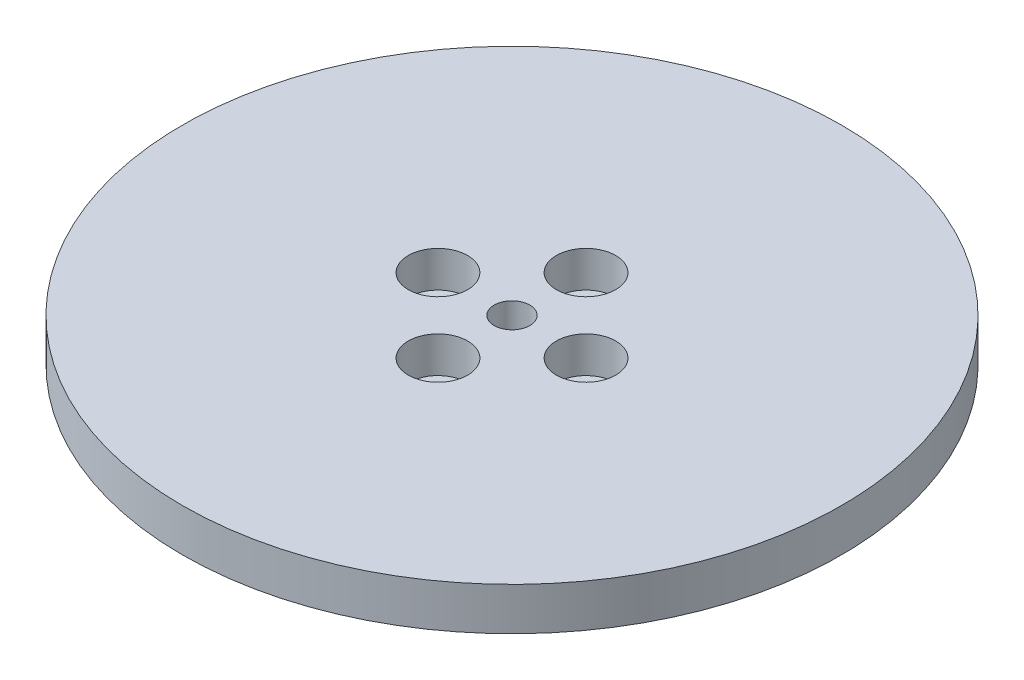
ISO-10303-21;
HEADER;
FILE_DESCRIPTION(('STEP AP214'),'2;1');
FILE_NAME('part.step','',(''),(''),'','','');
FILE_SCHEMA(('AUTOMOTIVE_DESIGN { 1 0 10303 214 1 1 1 1 }'));
ENDSEC;
DATA;
#1=APPLICATION_CONTEXT('core data for automotive mechanical design processes');
#2=APPLICATION_PROTOCOL_DEFINITION('international standard','automotive_design',2000,#1);
#3=PRODUCT_CONTEXT('',#1,'mechanical');
#4=PRODUCT('Part','Part','',(#3));
#5=PRODUCT_RELATED_PRODUCT_CATEGORY('part','',(#4));
#6=PRODUCT_DEFINITION_FORMATION('','',#4);
#7=PRODUCT_DEFINITION_CONTEXT('part definition',#1,'design');
#8=PRODUCT_DEFINITION('design','',#6,#7);
#9=PRODUCT_DEFINITION_SHAPE('','',#8);
#10=(LENGTH_UNIT() NAMED_UNIT(*) SI_UNIT(.MILLI.,.METRE.));
#11=(NAMED_UNIT(*) PLANE_ANGLE_UNIT() SI_UNIT($,.RADIAN.));
#12=(NAMED_UNIT(*) SI_UNIT($,.STERADIAN.) SOLID_ANGLE_UNIT());
#13=UNCERTAINTY_MEASURE_WITH_UNIT(LENGTH_MEASURE(1.E-05),#10,'distance_accuracy_value','');
#14=(GEOMETRIC_REPRESENTATION_CONTEXT(3) GLOBAL_UNCERTAINTY_ASSIGNED_CONTEXT((#13)) GLOBAL_UNIT_ASSIGNED_CONTEXT((#10,
#11,#12)) REPRESENTATION_CONTEXT('',''));
#15=CARTESIAN_POINT('',(0.,0.,0.));
#16=DIRECTION('',(0.,0.,1.));
#17=DIRECTION('',(1.,0.,0.));
#18=AXIS2_PLACEMENT_3D('',#15,#16,#17);
#19=CARTESIAN_POINT('',(0.,12.,0.));
#20=DIRECTION('',(0.,-1.,0.));
#21=DIRECTION('',(0.,0.,-1.));
#22=AXIS2_PLACEMENT_3D('',#19,#20,#21);
#23=CYLINDRICAL_SURFACE('',#22,92.5);
#24=CARTESIAN_POINT('',(0.,12.,0.));
#25=DIRECTION('',(0.,1.,0.));
#26=DIRECTION('',(0.,0.,1.));
#27=AXIS2_PLACEMENT_3D('',#24,#25,#26);
#28=CIRCLE('',#27,92.5);
#29=CARTESIAN_POINT('',(0.,12.,92.5));
#30=VERTEX_POINT('',#29);
#31=EDGE_CURVE('E10',#30,#30,#28,.T.);
#32=ORIENTED_EDGE('',*,*,#31,.F.);
#33=EDGE_LOOP('',(#32));
#34=FACE_BOUND('',#33,.T.);
#35=CARTESIAN_POINT('',(0.,0.,0.));
#36=DIRECTION('',(0.,1.,0.));
#37=DIRECTION('',(0.,0.,1.));
#38=AXIS2_PLACEMENT_3D('',#35,#36,#37);
#39=CIRCLE('',#38,92.5);
#40=CARTESIAN_POINT('',(0.,0.,92.5));
#41=VERTEX_POINT('',#40);
#42=EDGE_CURVE('E37',#41,#41,#39,.T.);
#43=ORIENTED_EDGE('',*,*,#42,.T.);
#44=EDGE_LOOP('',(#43));
#45=FACE_BOUND('',#44,.T.);
#46=ADVANCED_FACE('F40',(#34,#45),#23,.T.);
#47=CARTESIAN_POINT('',(0.,12.,0.));
#48=DIRECTION('',(0.,1.,0.));
#49=DIRECTION('',(0.,0.,1.));
#50=AXIS2_PLACEMENT_3D('',#47,#48,#49);
#51=PLANE('',#50);
#52=CARTESIAN_POINT('',(0.,12.,20.7800999065348));
#53=DIRECTION('',(0.,1.,0.));
#54=DIRECTION('',(1.,0.,0.));
#55=AXIS2_PLACEMENT_3D('',#52,#53,#54);
#56=CIRCLE('',#55,8.32447648272756);
#57=CARTESIAN_POINT('',(8.32447648272764,12.,20.7800999065348));
#58=VERTEX_POINT('',#57);
#59=EDGE_CURVE('E71',#58,#58,#56,.T.);
#60=ORIENTED_EDGE('',*,*,#59,.F.);
#61=EDGE_LOOP('',(#60));
#62=FACE_BOUND('',#61,.T.);
#63=CARTESIAN_POINT('',(20.7800999065348,12.,0.));
#64=DIRECTION('',(0.,1.,0.));
#65=DIRECTION('',(0.,0.,-1.));
#66=AXIS2_PLACEMENT_3D('',#63,#64,#65);
#67=CIRCLE('',#66,8.32447648272756);
#68=CARTESIAN_POINT('',(20.7800999065348,12.,-8.32447648272756));
#69=VERTEX_POINT('',#68);
#70=EDGE_CURVE('E70',#69,#69,#67,.T.);
#71=ORIENTED_EDGE('',*,*,#70,.F.);
#72=EDGE_LOOP('',(#71));
#73=FACE_BOUND('',#72,.T.);
#74=CARTESIAN_POINT('',(-2.17659993128887E-13,12.,-20.7800999065348));
#75=DIRECTION('',(0.,1.,0.));
#76=DIRECTION('',(-1.,0.,0.));
#77=AXIS2_PLACEMENT_3D('',#74,#75,#76);
#78=CIRCLE('',#77,8.32447648272756);
#79=CARTESIAN_POINT('',(-8.32447648272778,12.,-20.7800999065348));
#80=VERTEX_POINT('',#79);
#81=EDGE_CURVE('E61',#80,#80,#78,.T.);
#82=ORIENTED_EDGE('',*,*,#81,.F.);
#83=EDGE_LOOP('',(#82));
#84=FACE_BOUND('',#83,.T.);
#85=CARTESIAN_POINT('',(-20.7800999065348,12.,0.));
#86=DIRECTION('',(0.,1.,0.));
#87=DIRECTION('',(0.,0.,1.));
#88=AXIS2_PLACEMENT_3D('',#85,#86,#87);
#89=CIRCLE('',#88,8.32447648272756);
#90=CARTESIAN_POINT('',(-20.7800999065348,12.,8.32447648272756));
#91=VERTEX_POINT('',#90);
#92=EDGE_CURVE('E54',#91,#91,#89,.T.);
#93=ORIENTED_EDGE('',*,*,#92,.F.);
#94=EDGE_LOOP('',(#93));
#95=FACE_BOUND('',#94,.T.);
#96=CARTESIAN_POINT('',(0.,12.,0.));
#97=DIRECTION('',(0.,1.,0.));
#98=DIRECTION('',(0.,0.,1.));
#99=AXIS2_PLACEMENT_3D('',#96,#97,#98);
#100=CIRCLE('',#99,5.);
#101=CARTESIAN_POINT('',(0.,12.,5.));
#102=VERTEX_POINT('',#101);
#103=EDGE_CURVE('E50',#102,#102,#100,.T.);
#104=ORIENTED_EDGE('',*,*,#103,.F.);
#105=EDGE_LOOP('',(#104));
#106=FACE_BOUND('',#105,.T.);
#107=ORIENTED_EDGE('',*,*,#31,.T.);
#108=EDGE_LOOP('',(#107));
#109=FACE_BOUND('',#108,.T.);
#110=ADVANCED_FACE('F86',(#62,#73,#84,#95,#106,#109),#51,.T.);
#111=CARTESIAN_POINT('',(0.,0.,0.));
#112=DIRECTION('',(0.,1.,0.));
#113=DIRECTION('',(0.,0.,1.));
#114=AXIS2_PLACEMENT_3D('',#111,#112,#113);
#115=PLANE('',#114);
#116=CARTESIAN_POINT('',(0.,0.,0.));
#117=DIRECTION('',(0.,1.,0.));
#118=DIRECTION('',(0.,0.,1.));
#119=AXIS2_PLACEMENT_3D('',#116,#117,#118);
#120=CIRCLE('',#119,5.);
#121=CARTESIAN_POINT('',(0.,0.,5.));
#122=VERTEX_POINT('',#121);
#123=EDGE_CURVE('E47',#122,#122,#120,.T.);
#124=ORIENTED_EDGE('',*,*,#123,.T.);
#125=EDGE_LOOP('',(#124));
#126=FACE_BOUND('',#125,.T.);
#127=ORIENTED_EDGE('',*,*,#42,.F.);
#128=EDGE_LOOP('',(#127));
#129=FACE_BOUND('',#128,.T.);
#130=ADVANCED_FACE('F93',(#126,#129),#115,.F.);
#131=CARTESIAN_POINT('',(0.,12.,0.));
#132=DIRECTION('',(0.,-1.,0.));
#133=DIRECTION('',(0.,0.,-1.));
#134=AXIS2_PLACEMENT_3D('',#131,#132,#133);
#135=CYLINDRICAL_SURFACE('',#134,5.);
#136=ORIENTED_EDGE('',*,*,#103,.T.);
#137=EDGE_LOOP('',(#136));
#138=FACE_BOUND('',#137,.T.);
#139=ORIENTED_EDGE('',*,*,#123,.F.);
#140=EDGE_LOOP('',(#139));
#141=FACE_BOUND('',#140,.T.);
#142=ADVANCED_FACE('F101',(#138,#141),#135,.F.);
#143=CARTESIAN_POINT('',(-20.7800999065348,1.85385306498781,0.));
#144=DIRECTION('',(0.,1.,0.));
#145=DIRECTION('',(0.,0.,1.));
#146=AXIS2_PLACEMENT_3D('',#143,#144,#145);
#147=CYLINDRICAL_SURFACE('',#146,8.32447648272756);
#148=CARTESIAN_POINT('',(-20.7800999065348,1.85385306498781,0.));
#149=DIRECTION('',(0.,1.,0.));
#150=DIRECTION('',(0.,0.,1.));
#151=AXIS2_PLACEMENT_3D('',#148,#149,#150);
#152=CIRCLE('',#151,8.32447648272756);
#153=CARTESIAN_POINT('',(-20.7800999065348,1.85385306498781,8.32447648272756));
#154=VERTEX_POINT('',#153);
#155=EDGE_CURVE('E55',#154,#154,#152,.T.);
#156=ORIENTED_EDGE('',*,*,#155,.F.);
#157=EDGE_LOOP('',(#156));
#158=FACE_BOUND('',#157,.T.);
#159=ORIENTED_EDGE('',*,*,#92,.T.);
#160=EDGE_LOOP('',(#159));
#161=FACE_BOUND('',#160,.T.);
#162=ADVANCED_FACE('F102',(#158,#161),#147,.F.);
#163=CARTESIAN_POINT('',(-20.7800999065348,1.85385306498781,0.));
#164=DIRECTION('',(0.,1.,0.));
#165=DIRECTION('',(0.,0.,1.));
#166=AXIS2_PLACEMENT_3D('',#163,#164,#165);
#167=PLANE('',#166);
#168=ORIENTED_EDGE('',*,*,#155,.T.);
#169=EDGE_LOOP('',(#168));
#170=FACE_BOUND('',#169,.T.);
#171=ADVANCED_FACE('F133',(#170),#167,.T.);
#172=CARTESIAN_POINT('',(-2.17659993128887E-13,1.85385306498781,-20.7800999065348));
#173=DIRECTION('',(0.,1.,0.));
#174=DIRECTION('',(0.,0.,1.));
#175=AXIS2_PLACEMENT_3D('',#172,#173,#174);
#176=CYLINDRICAL_SURFACE('',#175,8.32447648272756);
#177=CARTESIAN_POINT('',(-2.17659993128887E-13,1.85385306498781,-20.7800999065348));
#178=DIRECTION('',(0.,1.,0.));
#179=DIRECTION('',(-1.,0.,0.));
#180=AXIS2_PLACEMENT_3D('',#177,#178,#179);
#181=CIRCLE('',#180,8.32447648272756);
#182=CARTESIAN_POINT('',(-8.32447648272778,1.85385306498781,-20.7800999065348));
#183=VERTEX_POINT('',#182);
#184=EDGE_CURVE('E63',#183,#183,#181,.T.);
#185=ORIENTED_EDGE('',*,*,#184,.F.);
#186=EDGE_LOOP('',(#185));
#187=FACE_BOUND('',#186,.T.);
#188=ORIENTED_EDGE('',*,*,#81,.T.);
#189=EDGE_LOOP('',(#188));
#190=FACE_BOUND('',#189,.T.);
#191=ADVANCED_FACE('F142',(#187,#190),#176,.F.);
#192=CARTESIAN_POINT('',(-2.17659993128887E-13,1.85385306498781,-20.7800999065348));
#193=DIRECTION('',(0.,1.,0.));
#194=DIRECTION('',(-1.,0.,0.));
#195=AXIS2_PLACEMENT_3D('',#192,#193,#194);
#196=PLANE('',#195);
#197=ORIENTED_EDGE('',*,*,#184,.T.);
#198=EDGE_LOOP('',(#197));
#199=FACE_BOUND('',#198,.T.);
#200=ADVANCED_FACE('F156',(#199),#196,.T.);
#201=CARTESIAN_POINT('',(20.7800999065348,1.85385306498781,0.));
#202=DIRECTION('',(0.,1.,0.));
#203=DIRECTION('',(0.,0.,1.));
#204=AXIS2_PLACEMENT_3D('',#201,#202,#203);
#205=CYLINDRICAL_SURFACE('',#204,8.32447648272756);
#206=CARTESIAN_POINT('',(20.7800999065348,1.85385306498781,0.));
#207=DIRECTION('',(0.,1.,0.));
#208=DIRECTION('',(0.,0.,-1.));
#209=AXIS2_PLACEMENT_3D('',#206,#207,#208);
#210=CIRCLE('',#209,8.32447648272756);
#211=CARTESIAN_POINT('',(20.7800999065348,1.85385306498781,-8.32447648272756));
#212=VERTEX_POINT('',#211);
#213=EDGE_CURVE('E69',#212,#212,#210,.T.);
#214=ORIENTED_EDGE('',*,*,#213,.F.);
#215=EDGE_LOOP('',(#214));
#216=FACE_BOUND('',#215,.T.);
#217=ORIENTED_EDGE('',*,*,#70,.T.);
#218=EDGE_LOOP('',(#217));
#219=FACE_BOUND('',#218,.T.);
#220=ADVANCED_FACE('F164',(#216,#219),#205,.F.);
#221=CARTESIAN_POINT('',(20.7800999065348,1.85385306498781,0.));
#222=DIRECTION('',(0.,1.,0.));
#223=DIRECTION('',(0.,0.,-1.));
#224=AXIS2_PLACEMENT_3D('',#221,#222,#223);
#225=PLANE('',#224);
#226=ORIENTED_EDGE('',*,*,#213,.T.);
#227=EDGE_LOOP('',(#226));
#228=FACE_BOUND('',#227,.T.);
#229=ADVANCED_FACE('F83',(#228),#225,.T.);
#230=CARTESIAN_POINT('',(0.,1.85385306498781,20.7800999065348));
#231=DIRECTION('',(0.,1.,0.));
#232=DIRECTION('',(0.,0.,1.));
#233=AXIS2_PLACEMENT_3D('',#230,#231,#232);
#234=CYLINDRICAL_SURFACE('',#233,8.32447648272756);
#235=CARTESIAN_POINT('',(0.,1.85385306498781,20.7800999065348));
#236=DIRECTION('',(0.,1.,0.));
#237=DIRECTION('',(1.,0.,0.));
#238=AXIS2_PLACEMENT_3D('',#235,#236,#237);
#239=CIRCLE('',#238,8.32447648272756);
#240=CARTESIAN_POINT('',(8.32447648272764,1.85385306498781,20.7800999065348));
#241=VERTEX_POINT('',#240);
#242=EDGE_CURVE('E59',#241,#241,#239,.T.);
#243=ORIENTED_EDGE('',*,*,#242,.F.);
#244=EDGE_LOOP('',(#243));
#245=FACE_BOUND('',#244,.T.);
#246=ORIENTED_EDGE('',*,*,#59,.T.);
#247=EDGE_LOOP('',(#246));
#248=FACE_BOUND('',#247,.T.);
#249=ADVANCED_FACE('F81',(#245,#248),#234,.F.);
#250=CARTESIAN_POINT('',(0.,1.85385306498781,20.7800999065348));
#251=DIRECTION('',(0.,1.,0.));
#252=DIRECTION('',(1.,0.,0.));
#253=AXIS2_PLACEMENT_3D('',#250,#251,#252);
#254=PLANE('',#253);
#255=ORIENTED_EDGE('',*,*,#242,.T.);
#256=EDGE_LOOP('',(#255));
#257=FACE_BOUND('',#256,.T.);
#258=ADVANCED_FACE('F78',(#257),#254,.T.);
#259=CLOSED_SHELL('',(#46,#110,#130,#142,#162,#171,#191,#200,#220,#229,#249,#258));
#260=MANIFOLD_SOLID_BREP('B2',#259);
#261=ADVANCED_BREP_SHAPE_REPRESENTATION('',(#18,#260),#14);
#262=SHAPE_DEFINITION_REPRESENTATION(#9,#261);
ENDSEC;
END-ISO-10303-21;
